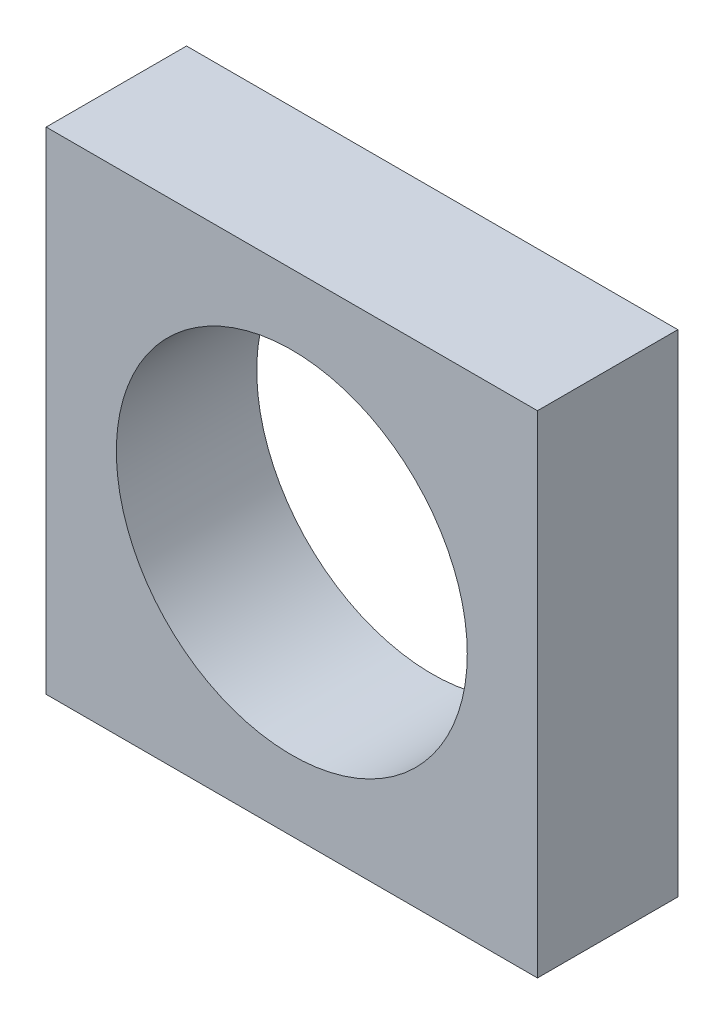
ISO-10303-21;
HEADER;
FILE_DESCRIPTION(('STEP AP214'),'2;1');
FILE_NAME('part.step','',(''),(''),'','','');
FILE_SCHEMA(('AUTOMOTIVE_DESIGN { 1 0 10303 214 1 1 1 1 }'));
ENDSEC;
DATA;
#1=APPLICATION_CONTEXT('core data for automotive mechanical design processes');
#2=APPLICATION_PROTOCOL_DEFINITION('international standard','automotive_design',2000,#1);
#3=PRODUCT_CONTEXT('',#1,'mechanical');
#4=PRODUCT('Part','Part','',(#3));
#5=PRODUCT_RELATED_PRODUCT_CATEGORY('part','',(#4));
#6=PRODUCT_DEFINITION_FORMATION('','',#4);
#7=PRODUCT_DEFINITION_CONTEXT('part definition',#1,'design');
#8=PRODUCT_DEFINITION('design','',#6,#7);
#9=PRODUCT_DEFINITION_SHAPE('','',#8);
#10=(LENGTH_UNIT() NAMED_UNIT(*) SI_UNIT(.MILLI.,.METRE.));
#11=(NAMED_UNIT(*) PLANE_ANGLE_UNIT() SI_UNIT($,.RADIAN.));
#12=(NAMED_UNIT(*) SI_UNIT($,.STERADIAN.) SOLID_ANGLE_UNIT());
#13=UNCERTAINTY_MEASURE_WITH_UNIT(LENGTH_MEASURE(1.E-05),#10,'distance_accuracy_value','');
#14=(GEOMETRIC_REPRESENTATION_CONTEXT(3) GLOBAL_UNCERTAINTY_ASSIGNED_CONTEXT((#13)) GLOBAL_UNIT_ASSIGNED_CONTEXT((#10,
#11,#12)) REPRESENTATION_CONTEXT('',''));
#15=CARTESIAN_POINT('',(0.,0.,0.));
#16=DIRECTION('',(0.,0.,1.));
#17=DIRECTION('',(1.,0.,0.));
#18=AXIS2_PLACEMENT_3D('',#15,#16,#17);
#19=CARTESIAN_POINT('',(0.,0.,1.));
#20=DIRECTION('',(0.,0.,1.));
#21=DIRECTION('',(1.,0.,0.));
#22=AXIS2_PLACEMENT_3D('',#19,#20,#21);
#23=PLANE('',#22);
#24=DIRECTION('',(0.,1.,0.));
#25=VECTOR('',#24,1.);
#26=CARTESIAN_POINT('',(3.5,3.5,1.));
#27=LINE('',#26,#25);
#28=CARTESIAN_POINT('',(3.5,-3.5,1.));
#29=VERTEX_POINT('',#28);
#30=CARTESIAN_POINT('',(3.5,3.5,1.));
#31=VERTEX_POINT('',#30);
#32=EDGE_CURVE('E89',#29,#31,#27,.T.);
#33=ORIENTED_EDGE('',*,*,#32,.T.);
#34=DIRECTION('',(-1.,0.,0.));
#35=VECTOR('',#34,1.);
#36=CARTESIAN_POINT('',(-3.5,3.5,1.));
#37=LINE('',#36,#35);
#38=CARTESIAN_POINT('',(-3.5,3.5,1.));
#39=VERTEX_POINT('',#38);
#40=EDGE_CURVE('E84',#31,#39,#37,.T.);
#41=ORIENTED_EDGE('',*,*,#40,.T.);
#42=DIRECTION('',(0.,-1.,0.));
#43=VECTOR('',#42,1.);
#44=CARTESIAN_POINT('',(-3.5,3.5,1.));
#45=LINE('',#44,#43);
#46=CARTESIAN_POINT('',(-3.5,-3.5,1.));
#47=VERTEX_POINT('',#46);
#48=EDGE_CURVE('E87',#39,#47,#45,.T.);
#49=ORIENTED_EDGE('',*,*,#48,.T.);
#50=DIRECTION('',(1.,0.,0.));
#51=VECTOR('',#50,1.);
#52=CARTESIAN_POINT('',(-3.5,-3.5,1.));
#53=LINE('',#52,#51);
#54=EDGE_CURVE('E54',#47,#29,#53,.T.);
#55=ORIENTED_EDGE('',*,*,#54,.T.);
#56=EDGE_LOOP('',(#33,#41,#49,#55));
#57=FACE_BOUND('',#56,.T.);
#58=CARTESIAN_POINT('',(0.,0.,1.));
#59=DIRECTION('',(0.,0.,1.));
#60=DIRECTION('',(1.,0.,0.));
#61=AXIS2_PLACEMENT_3D('',#58,#59,#60);
#62=CIRCLE('',#61,2.5);
#63=CARTESIAN_POINT('',(2.5,0.,1.));
#64=VERTEX_POINT('',#63);
#65=EDGE_CURVE('E104',#64,#64,#62,.T.);
#66=ORIENTED_EDGE('',*,*,#65,.F.);
#67=EDGE_LOOP('',(#66));
#68=FACE_BOUND('',#67,.T.);
#69=ADVANCED_FACE('F37',(#57,#68),#23,.T.);
#70=CARTESIAN_POINT('',(0.,0.,-1.));
#71=DIRECTION('',(0.,0.,1.));
#72=DIRECTION('',(1.,0.,0.));
#73=AXIS2_PLACEMENT_3D('',#70,#71,#72);
#74=PLANE('',#73);
#75=DIRECTION('',(0.,1.,0.));
#76=VECTOR('',#75,1.);
#77=CARTESIAN_POINT('',(3.5,3.5,-1.));
#78=LINE('',#77,#76);
#79=CARTESIAN_POINT('',(3.5,-3.5,-1.));
#80=VERTEX_POINT('',#79);
#81=CARTESIAN_POINT('',(3.5,3.5,-1.));
#82=VERTEX_POINT('',#81);
#83=EDGE_CURVE('E101',#80,#82,#78,.T.);
#84=ORIENTED_EDGE('',*,*,#83,.F.);
#85=DIRECTION('',(1.,0.,0.));
#86=VECTOR('',#85,1.);
#87=CARTESIAN_POINT('',(-3.5,-3.5,-1.));
#88=LINE('',#87,#86);
#89=CARTESIAN_POINT('',(-3.5,-3.5,-1.));
#90=VERTEX_POINT('',#89);
#91=EDGE_CURVE('E77',#90,#80,#88,.T.);
#92=ORIENTED_EDGE('',*,*,#91,.F.);
#93=DIRECTION('',(0.,-1.,0.));
#94=VECTOR('',#93,1.);
#95=CARTESIAN_POINT('',(-3.5,3.5,-1.));
#96=LINE('',#95,#94);
#97=CARTESIAN_POINT('',(-3.5,3.5,-1.));
#98=VERTEX_POINT('',#97);
#99=EDGE_CURVE('E71',#98,#90,#96,.T.);
#100=ORIENTED_EDGE('',*,*,#99,.F.);
#101=DIRECTION('',(-1.,0.,0.));
#102=VECTOR('',#101,1.);
#103=CARTESIAN_POINT('',(-3.5,3.5,-1.));
#104=LINE('',#103,#102);
#105=EDGE_CURVE('E93',#82,#98,#104,.T.);
#106=ORIENTED_EDGE('',*,*,#105,.F.);
#107=EDGE_LOOP('',(#84,#92,#100,#106));
#108=FACE_BOUND('',#107,.T.);
#109=CARTESIAN_POINT('',(0.,0.,-1.));
#110=DIRECTION('',(0.,0.,1.));
#111=DIRECTION('',(1.,0.,0.));
#112=AXIS2_PLACEMENT_3D('',#109,#110,#111);
#113=CIRCLE('',#112,2.5);
#114=CARTESIAN_POINT('',(2.5,0.,-1.));
#115=VERTEX_POINT('',#114);
#116=EDGE_CURVE('E116',#115,#115,#113,.T.);
#117=ORIENTED_EDGE('',*,*,#116,.T.);
#118=EDGE_LOOP('',(#117));
#119=FACE_BOUND('',#118,.T.);
#120=ADVANCED_FACE('F112',(#108,#119),#74,.F.);
#121=CARTESIAN_POINT('',(3.5,3.5,1.));
#122=DIRECTION('',(-1.,0.,0.));
#123=DIRECTION('',(0.,-1.,0.));
#124=AXIS2_PLACEMENT_3D('',#121,#122,#123);
#125=PLANE('',#124);
#126=ORIENTED_EDGE('',*,*,#83,.T.);
#127=DIRECTION('',(0.,0.,-1.));
#128=VECTOR('',#127,1.);
#129=CARTESIAN_POINT('',(3.5,3.5,1.));
#130=LINE('',#129,#128);
#131=EDGE_CURVE('E11',#31,#82,#130,.T.);
#132=ORIENTED_EDGE('',*,*,#131,.F.);
#133=ORIENTED_EDGE('',*,*,#32,.F.);
#134=DIRECTION('',(0.,0.,-1.));
#135=VECTOR('',#134,1.);
#136=CARTESIAN_POINT('',(3.5,-3.5,1.));
#137=LINE('',#136,#135);
#138=EDGE_CURVE('E97',#29,#80,#137,.T.);
#139=ORIENTED_EDGE('',*,*,#138,.T.);
#140=EDGE_LOOP('',(#126,#132,#133,#139));
#141=FACE_BOUND('',#140,.T.);
#142=ADVANCED_FACE('F39',(#141),#125,.F.);
#143=CARTESIAN_POINT('',(-3.5,3.5,1.));
#144=DIRECTION('',(0.,-1.,0.));
#145=DIRECTION('',(0.,0.,-1.));
#146=AXIS2_PLACEMENT_3D('',#143,#144,#145);
#147=PLANE('',#146);
#148=ORIENTED_EDGE('',*,*,#105,.T.);
#149=DIRECTION('',(0.,0.,-1.));
#150=VECTOR('',#149,1.);
#151=CARTESIAN_POINT('',(-3.5,3.5,1.));
#152=LINE('',#151,#150);
#153=EDGE_CURVE('E46',#39,#98,#152,.T.);
#154=ORIENTED_EDGE('',*,*,#153,.F.);
#155=ORIENTED_EDGE('',*,*,#40,.F.);
#156=ORIENTED_EDGE('',*,*,#131,.T.);
#157=EDGE_LOOP('',(#148,#154,#155,#156));
#158=FACE_BOUND('',#157,.T.);
#159=ADVANCED_FACE('F92',(#158),#147,.F.);
#160=CARTESIAN_POINT('',(-3.5,3.5,1.));
#161=DIRECTION('',(1.,0.,0.));
#162=DIRECTION('',(0.,1.,0.));
#163=AXIS2_PLACEMENT_3D('',#160,#161,#162);
#164=PLANE('',#163);
#165=ORIENTED_EDGE('',*,*,#99,.T.);
#166=DIRECTION('',(0.,0.,-1.));
#167=VECTOR('',#166,1.);
#168=CARTESIAN_POINT('',(-3.5,-3.5,1.));
#169=LINE('',#168,#167);
#170=EDGE_CURVE('E94',#47,#90,#169,.T.);
#171=ORIENTED_EDGE('',*,*,#170,.F.);
#172=ORIENTED_EDGE('',*,*,#48,.F.);
#173=ORIENTED_EDGE('',*,*,#153,.T.);
#174=EDGE_LOOP('',(#165,#171,#172,#173));
#175=FACE_BOUND('',#174,.T.);
#176=ADVANCED_FACE('F95',(#175),#164,.F.);
#177=CARTESIAN_POINT('',(-3.5,-3.5,1.));
#178=DIRECTION('',(0.,1.,0.));
#179=DIRECTION('',(0.,0.,1.));
#180=AXIS2_PLACEMENT_3D('',#177,#178,#179);
#181=PLANE('',#180);
#182=ORIENTED_EDGE('',*,*,#91,.T.);
#183=ORIENTED_EDGE('',*,*,#138,.F.);
#184=ORIENTED_EDGE('',*,*,#54,.F.);
#185=ORIENTED_EDGE('',*,*,#170,.T.);
#186=EDGE_LOOP('',(#182,#183,#184,#185));
#187=FACE_BOUND('',#186,.T.);
#188=ADVANCED_FACE('F109',(#187),#181,.F.);
#189=CARTESIAN_POINT('',(0.,0.,1.));
#190=DIRECTION('',(0.,0.,-1.));
#191=DIRECTION('',(-1.,0.,0.));
#192=AXIS2_PLACEMENT_3D('',#189,#190,#191);
#193=CYLINDRICAL_SURFACE('',#192,2.5);
#194=ORIENTED_EDGE('',*,*,#65,.T.);
#195=EDGE_LOOP('',(#194));
#196=FACE_BOUND('',#195,.T.);
#197=ORIENTED_EDGE('',*,*,#116,.F.);
#198=EDGE_LOOP('',(#197));
#199=FACE_BOUND('',#198,.T.);
#200=ADVANCED_FACE('F122',(#196,#199),#193,.F.);
#201=CLOSED_SHELL('',(#69,#120,#142,#159,#176,#188,#200));
#202=MANIFOLD_SOLID_BREP('B2',#201);
#203=ADVANCED_BREP_SHAPE_REPRESENTATION('',(#18,#202),#14);
#204=SHAPE_DEFINITION_REPRESENTATION(#9,#203);
ENDSEC;
END-ISO-10303-21;
